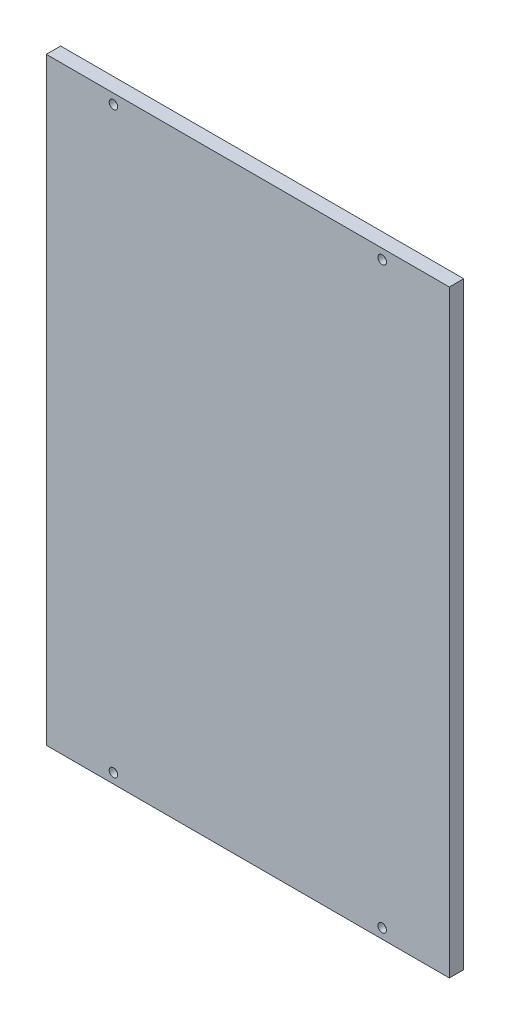
ISO-10303-21;
HEADER;
FILE_DESCRIPTION(('STEP AP214'),'2;1');
FILE_NAME('part.step','',(''),(''),'','','');
FILE_SCHEMA(('AUTOMOTIVE_DESIGN { 1 0 10303 214 1 1 1 1 }'));
ENDSEC;
DATA;
#1=APPLICATION_CONTEXT('core data for automotive mechanical design processes');
#2=APPLICATION_PROTOCOL_DEFINITION('international standard','automotive_design',2000,#1);
#3=PRODUCT_CONTEXT('',#1,'mechanical');
#4=PRODUCT('Part','Part','',(#3));
#5=PRODUCT_RELATED_PRODUCT_CATEGORY('part','',(#4));
#6=PRODUCT_DEFINITION_FORMATION('','',#4);
#7=PRODUCT_DEFINITION_CONTEXT('part definition',#1,'design');
#8=PRODUCT_DEFINITION('design','',#6,#7);
#9=PRODUCT_DEFINITION_SHAPE('','',#8);
#10=(LENGTH_UNIT() NAMED_UNIT(*) SI_UNIT(.MILLI.,.METRE.));
#11=(NAMED_UNIT(*) PLANE_ANGLE_UNIT() SI_UNIT($,.RADIAN.));
#12=(NAMED_UNIT(*) SI_UNIT($,.STERADIAN.) SOLID_ANGLE_UNIT());
#13=UNCERTAINTY_MEASURE_WITH_UNIT(LENGTH_MEASURE(1.E-05),#10,'distance_accuracy_value','');
#14=(GEOMETRIC_REPRESENTATION_CONTEXT(3) GLOBAL_UNCERTAINTY_ASSIGNED_CONTEXT((#13)) GLOBAL_UNIT_ASSIGNED_CONTEXT((#10,
#11,#12)) REPRESENTATION_CONTEXT('',''));
#15=CARTESIAN_POINT('',(0.,0.,0.));
#16=DIRECTION('',(0.,0.,1.));
#17=DIRECTION('',(1.,0.,0.));
#18=AXIS2_PLACEMENT_3D('',#15,#16,#17);
#19=CARTESIAN_POINT('',(-150.,-222.7,10.7));
#20=DIRECTION('',(1.,0.,0.));
#21=DIRECTION('',(0.,0.,-1.));
#22=AXIS2_PLACEMENT_3D('',#19,#20,#21);
#23=PLANE('',#22);
#24=DIRECTION('',(0.,-1.,0.));
#25=VECTOR('',#24,1.);
#26=CARTESIAN_POINT('',(-150.,-222.7,0.));
#27=LINE('',#26,#25);
#28=CARTESIAN_POINT('',(-150.,222.7,0.));
#29=VERTEX_POINT('',#28);
#30=CARTESIAN_POINT('',(-150.,-222.7,0.));
#31=VERTEX_POINT('',#30);
#32=EDGE_CURVE('E96',#29,#31,#27,.T.);
#33=ORIENTED_EDGE('',*,*,#32,.T.);
#34=DIRECTION('',(0.,0.,-1.));
#35=VECTOR('',#34,1.);
#36=CARTESIAN_POINT('',(-150.,-222.7,10.7));
#37=LINE('',#36,#35);
#38=CARTESIAN_POINT('',(-150.,-222.7,10.7));
#39=VERTEX_POINT('',#38);
#40=EDGE_CURVE('E11',#39,#31,#37,.T.);
#41=ORIENTED_EDGE('',*,*,#40,.F.);
#42=DIRECTION('',(0.,-1.,0.));
#43=VECTOR('',#42,1.);
#44=CARTESIAN_POINT('',(-150.,-222.7,10.7));
#45=LINE('',#44,#43);
#46=CARTESIAN_POINT('',(-150.,222.7,10.7));
#47=VERTEX_POINT('',#46);
#48=EDGE_CURVE('E84',#47,#39,#45,.T.);
#49=ORIENTED_EDGE('',*,*,#48,.F.);
#50=DIRECTION('',(0.,0.,-1.));
#51=VECTOR('',#50,1.);
#52=CARTESIAN_POINT('',(-150.,222.7,10.7));
#53=LINE('',#52,#51);
#54=EDGE_CURVE('E92',#47,#29,#53,.T.);
#55=ORIENTED_EDGE('',*,*,#54,.T.);
#56=EDGE_LOOP('',(#33,#41,#49,#55));
#57=FACE_BOUND('',#56,.T.);
#58=ADVANCED_FACE('F33',(#57),#23,.F.);
#59=CARTESIAN_POINT('',(150.,-222.7,10.7));
#60=DIRECTION('',(0.,1.,0.));
#61=DIRECTION('',(0.,0.,1.));
#62=AXIS2_PLACEMENT_3D('',#59,#60,#61);
#63=PLANE('',#62);
#64=DIRECTION('',(1.,0.,0.));
#65=VECTOR('',#64,1.);
#66=CARTESIAN_POINT('',(150.,-222.7,0.));
#67=LINE('',#66,#65);
#68=CARTESIAN_POINT('',(150.,-222.7,0.));
#69=VERTEX_POINT('',#68);
#70=EDGE_CURVE('E88',#31,#69,#67,.T.);
#71=ORIENTED_EDGE('',*,*,#70,.T.);
#72=DIRECTION('',(0.,0.,-1.));
#73=VECTOR('',#72,1.);
#74=CARTESIAN_POINT('',(150.,-222.7,10.7));
#75=LINE('',#74,#73);
#76=CARTESIAN_POINT('',(150.,-222.7,10.7));
#77=VERTEX_POINT('',#76);
#78=EDGE_CURVE('E41',#77,#69,#75,.T.);
#79=ORIENTED_EDGE('',*,*,#78,.F.);
#80=DIRECTION('',(1.,0.,0.));
#81=VECTOR('',#80,1.);
#82=CARTESIAN_POINT('',(150.,-222.7,10.7));
#83=LINE('',#82,#81);
#84=EDGE_CURVE('E79',#39,#77,#83,.T.);
#85=ORIENTED_EDGE('',*,*,#84,.F.);
#86=ORIENTED_EDGE('',*,*,#40,.T.);
#87=EDGE_LOOP('',(#71,#79,#85,#86));
#88=FACE_BOUND('',#87,.T.);
#89=ADVANCED_FACE('F87',(#88),#63,.F.);
#90=CARTESIAN_POINT('',(150.,-222.7,10.7));
#91=DIRECTION('',(-1.,0.,0.));
#92=DIRECTION('',(0.,0.,1.));
#93=AXIS2_PLACEMENT_3D('',#90,#91,#92);
#94=PLANE('',#93);
#95=DIRECTION('',(0.,1.,0.));
#96=VECTOR('',#95,1.);
#97=CARTESIAN_POINT('',(150.,-222.7,0.));
#98=LINE('',#97,#96);
#99=CARTESIAN_POINT('',(150.,222.7,0.));
#100=VERTEX_POINT('',#99);
#101=EDGE_CURVE('E66',#69,#100,#98,.T.);
#102=ORIENTED_EDGE('',*,*,#101,.T.);
#103=DIRECTION('',(0.,0.,-1.));
#104=VECTOR('',#103,1.);
#105=CARTESIAN_POINT('',(150.,222.7,10.7));
#106=LINE('',#105,#104);
#107=CARTESIAN_POINT('',(150.,222.7,10.7));
#108=VERTEX_POINT('',#107);
#109=EDGE_CURVE('E89',#108,#100,#106,.T.);
#110=ORIENTED_EDGE('',*,*,#109,.F.);
#111=DIRECTION('',(0.,1.,0.));
#112=VECTOR('',#111,1.);
#113=CARTESIAN_POINT('',(150.,-222.7,10.7));
#114=LINE('',#113,#112);
#115=EDGE_CURVE('E82',#77,#108,#114,.T.);
#116=ORIENTED_EDGE('',*,*,#115,.F.);
#117=ORIENTED_EDGE('',*,*,#78,.T.);
#118=EDGE_LOOP('',(#102,#110,#116,#117));
#119=FACE_BOUND('',#118,.T.);
#120=ADVANCED_FACE('F90',(#119),#94,.F.);
#121=CARTESIAN_POINT('',(150.,222.7,10.7));
#122=DIRECTION('',(0.,-1.,0.));
#123=DIRECTION('',(0.,0.,-1.));
#124=AXIS2_PLACEMENT_3D('',#121,#122,#123);
#125=PLANE('',#124);
#126=DIRECTION('',(-1.,0.,0.));
#127=VECTOR('',#126,1.);
#128=CARTESIAN_POINT('',(150.,222.7,0.));
#129=LINE('',#128,#127);
#130=EDGE_CURVE('E72',#100,#29,#129,.T.);
#131=ORIENTED_EDGE('',*,*,#130,.T.);
#132=ORIENTED_EDGE('',*,*,#54,.F.);
#133=DIRECTION('',(-1.,0.,0.));
#134=VECTOR('',#133,1.);
#135=CARTESIAN_POINT('',(150.,222.7,10.7));
#136=LINE('',#135,#134);
#137=EDGE_CURVE('E49',#108,#47,#136,.T.);
#138=ORIENTED_EDGE('',*,*,#137,.F.);
#139=ORIENTED_EDGE('',*,*,#109,.T.);
#140=EDGE_LOOP('',(#131,#132,#138,#139));
#141=FACE_BOUND('',#140,.T.);
#142=ADVANCED_FACE('F104',(#141),#125,.F.);
#143=CARTESIAN_POINT('',(0.,0.,10.7));
#144=DIRECTION('',(0.,0.,1.));
#145=DIRECTION('',(1.,0.,0.));
#146=AXIS2_PLACEMENT_3D('',#143,#144,#145);
#147=PLANE('',#146);
#148=CARTESIAN_POINT('',(100.,215.35,10.7));
#149=DIRECTION('',(0.,0.,-1.));
#150=DIRECTION('',(-1.,0.,0.));
#151=AXIS2_PLACEMENT_3D('',#148,#149,#150);
#152=CIRCLE('',#151,3.17500000000001);
#153=CARTESIAN_POINT('',(96.825,215.35,10.7));
#154=VERTEX_POINT('',#153);
#155=EDGE_CURVE('E145',#154,#154,#152,.T.);
#156=ORIENTED_EDGE('',*,*,#155,.T.);
#157=EDGE_LOOP('',(#156));
#158=FACE_BOUND('',#157,.T.);
#159=CARTESIAN_POINT('',(100.,-215.35,10.7));
#160=DIRECTION('',(0.,0.,-1.));
#161=DIRECTION('',(-1.,0.,0.));
#162=AXIS2_PLACEMENT_3D('',#159,#160,#161);
#163=CIRCLE('',#162,3.17500000000001);
#164=CARTESIAN_POINT('',(96.825,-215.35,10.7));
#165=VERTEX_POINT('',#164);
#166=EDGE_CURVE('E133',#165,#165,#163,.T.);
#167=ORIENTED_EDGE('',*,*,#166,.T.);
#168=EDGE_LOOP('',(#167));
#169=FACE_BOUND('',#168,.T.);
#170=CARTESIAN_POINT('',(-100.,-215.35,10.7));
#171=DIRECTION('',(0.,0.,-1.));
#172=DIRECTION('',(-1.,0.,0.));
#173=AXIS2_PLACEMENT_3D('',#170,#171,#172);
#174=CIRCLE('',#173,3.17500000000001);
#175=CARTESIAN_POINT('',(-103.175,-215.35,10.7));
#176=VERTEX_POINT('',#175);
#177=EDGE_CURVE('E121',#176,#176,#174,.T.);
#178=ORIENTED_EDGE('',*,*,#177,.T.);
#179=EDGE_LOOP('',(#178));
#180=FACE_BOUND('',#179,.T.);
#181=CARTESIAN_POINT('',(-100.,215.35,10.7));
#182=DIRECTION('',(0.,0.,-1.));
#183=DIRECTION('',(-1.,0.,0.));
#184=AXIS2_PLACEMENT_3D('',#181,#182,#183);
#185=CIRCLE('',#184,3.17500000000001);
#186=CARTESIAN_POINT('',(-103.175,215.35,10.7));
#187=VERTEX_POINT('',#186);
#188=EDGE_CURVE('E99',#187,#187,#185,.T.);
#189=ORIENTED_EDGE('',*,*,#188,.T.);
#190=EDGE_LOOP('',(#189));
#191=FACE_BOUND('',#190,.T.);
#192=ORIENTED_EDGE('',*,*,#48,.T.);
#193=ORIENTED_EDGE('',*,*,#84,.T.);
#194=ORIENTED_EDGE('',*,*,#115,.T.);
#195=ORIENTED_EDGE('',*,*,#137,.T.);
#196=EDGE_LOOP('',(#192,#193,#194,#195));
#197=FACE_BOUND('',#196,.T.);
#198=ADVANCED_FACE('F80',(#158,#169,#180,#191,#197),#147,.T.);
#199=CARTESIAN_POINT('',(0.,0.,0.));
#200=DIRECTION('',(0.,0.,1.));
#201=DIRECTION('',(1.,0.,0.));
#202=AXIS2_PLACEMENT_3D('',#199,#200,#201);
#203=PLANE('',#202);
#204=CARTESIAN_POINT('',(100.,215.35,0.));
#205=DIRECTION('',(0.,0.,-1.));
#206=DIRECTION('',(-1.,0.,0.));
#207=AXIS2_PLACEMENT_3D('',#204,#205,#206);
#208=CIRCLE('',#207,4.76000000000001);
#209=CARTESIAN_POINT('',(95.24,215.35,0.));
#210=VERTEX_POINT('',#209);
#211=EDGE_CURVE('E154',#210,#210,#208,.T.);
#212=ORIENTED_EDGE('',*,*,#211,.F.);
#213=EDGE_LOOP('',(#212));
#214=FACE_BOUND('',#213,.T.);
#215=CARTESIAN_POINT('',(100.,-215.35,0.));
#216=DIRECTION('',(0.,0.,-1.));
#217=DIRECTION('',(-1.,0.,0.));
#218=AXIS2_PLACEMENT_3D('',#215,#216,#217);
#219=CIRCLE('',#218,4.76000000000001);
#220=CARTESIAN_POINT('',(95.24,-215.35,0.));
#221=VERTEX_POINT('',#220);
#222=EDGE_CURVE('E142',#221,#221,#219,.T.);
#223=ORIENTED_EDGE('',*,*,#222,.F.);
#224=EDGE_LOOP('',(#223));
#225=FACE_BOUND('',#224,.T.);
#226=CARTESIAN_POINT('',(-100.,-215.35,0.));
#227=DIRECTION('',(0.,0.,-1.));
#228=DIRECTION('',(-1.,0.,0.));
#229=AXIS2_PLACEMENT_3D('',#226,#227,#228);
#230=CIRCLE('',#229,4.76000000000001);
#231=CARTESIAN_POINT('',(-104.76,-215.35,0.));
#232=VERTEX_POINT('',#231);
#233=EDGE_CURVE('E130',#232,#232,#230,.T.);
#234=ORIENTED_EDGE('',*,*,#233,.F.);
#235=EDGE_LOOP('',(#234));
#236=FACE_BOUND('',#235,.T.);
#237=CARTESIAN_POINT('',(-100.,215.35,0.));
#238=DIRECTION('',(0.,0.,-1.));
#239=DIRECTION('',(-1.,0.,0.));
#240=AXIS2_PLACEMENT_3D('',#237,#238,#239);
#241=CIRCLE('',#240,4.76000000000001);
#242=CARTESIAN_POINT('',(-104.76,215.35,0.));
#243=VERTEX_POINT('',#242);
#244=EDGE_CURVE('E118',#243,#243,#241,.T.);
#245=ORIENTED_EDGE('',*,*,#244,.F.);
#246=EDGE_LOOP('',(#245));
#247=FACE_BOUND('',#246,.T.);
#248=ORIENTED_EDGE('',*,*,#32,.F.);
#249=ORIENTED_EDGE('',*,*,#130,.F.);
#250=ORIENTED_EDGE('',*,*,#101,.F.);
#251=ORIENTED_EDGE('',*,*,#70,.F.);
#252=EDGE_LOOP('',(#248,#249,#250,#251));
#253=FACE_BOUND('',#252,.T.);
#254=ADVANCED_FACE('F107',(#214,#225,#236,#247,#253),#203,.F.);
#255=CARTESIAN_POINT('',(-100.,215.35,0.));
#256=DIRECTION('',(0.,0.,-1.));
#257=DIRECTION('',(-1.,0.,0.));
#258=AXIS2_PLACEMENT_3D('',#255,#256,#257);
#259=CYLINDRICAL_SURFACE('',#258,3.17500000000001);
#260=ORIENTED_EDGE('',*,*,#188,.F.);
#261=EDGE_LOOP('',(#260));
#262=FACE_BOUND('',#261,.T.);
#263=CARTESIAN_POINT('',(-100.,215.35,6.35));
#264=DIRECTION('',(0.,0.,-1.));
#265=DIRECTION('',(-1.,0.,0.));
#266=AXIS2_PLACEMENT_3D('',#263,#264,#265);
#267=CIRCLE('',#266,3.17500000000001);
#268=CARTESIAN_POINT('',(-103.175,215.35,6.35));
#269=VERTEX_POINT('',#268);
#270=EDGE_CURVE('E112',#269,#269,#267,.T.);
#271=ORIENTED_EDGE('',*,*,#270,.T.);
#272=EDGE_LOOP('',(#271));
#273=FACE_BOUND('',#272,.T.);
#274=ADVANCED_FACE('F162',(#262,#273),#259,.F.);
#275=CARTESIAN_POINT('',(-96.825,215.35,6.35));
#276=DIRECTION('',(0.,0.,1.));
#277=DIRECTION('',(1.,0.,0.));
#278=AXIS2_PLACEMENT_3D('',#275,#276,#277);
#279=PLANE('',#278);
#280=ORIENTED_EDGE('',*,*,#270,.F.);
#281=EDGE_LOOP('',(#280));
#282=FACE_BOUND('',#281,.T.);
#283=CARTESIAN_POINT('',(-100.,215.35,6.35));
#284=DIRECTION('',(0.,0.,-1.));
#285=DIRECTION('',(-1.,0.,0.));
#286=AXIS2_PLACEMENT_3D('',#283,#284,#285);
#287=CIRCLE('',#286,4.76000000000001);
#288=CARTESIAN_POINT('',(-104.76,215.35,6.35));
#289=VERTEX_POINT('',#288);
#290=EDGE_CURVE('E115',#289,#289,#287,.T.);
#291=ORIENTED_EDGE('',*,*,#290,.T.);
#292=EDGE_LOOP('',(#291));
#293=FACE_BOUND('',#292,.T.);
#294=ADVANCED_FACE('F173',(#282,#293),#279,.F.);
#295=CARTESIAN_POINT('',(-100.,215.35,0.));
#296=DIRECTION('',(0.,0.,-1.));
#297=DIRECTION('',(-1.,0.,0.));
#298=AXIS2_PLACEMENT_3D('',#295,#296,#297);
#299=CYLINDRICAL_SURFACE('',#298,4.76000000000001);
#300=ORIENTED_EDGE('',*,*,#290,.F.);
#301=EDGE_LOOP('',(#300));
#302=FACE_BOUND('',#301,.T.);
#303=ORIENTED_EDGE('',*,*,#244,.T.);
#304=EDGE_LOOP('',(#303));
#305=FACE_BOUND('',#304,.T.);
#306=ADVANCED_FACE('F170',(#302,#305),#299,.F.);
#307=CARTESIAN_POINT('',(-100.,-215.35,0.));
#308=DIRECTION('',(0.,0.,-1.));
#309=DIRECTION('',(-1.,0.,0.));
#310=AXIS2_PLACEMENT_3D('',#307,#308,#309);
#311=CYLINDRICAL_SURFACE('',#310,3.17500000000001);
#312=ORIENTED_EDGE('',*,*,#177,.F.);
#313=EDGE_LOOP('',(#312));
#314=FACE_BOUND('',#313,.T.);
#315=CARTESIAN_POINT('',(-100.,-215.35,6.35));
#316=DIRECTION('',(0.,0.,-1.));
#317=DIRECTION('',(-1.,0.,0.));
#318=AXIS2_PLACEMENT_3D('',#315,#316,#317);
#319=CIRCLE('',#318,3.17500000000001);
#320=CARTESIAN_POINT('',(-103.175,-215.35,6.35));
#321=VERTEX_POINT('',#320);
#322=EDGE_CURVE('E124',#321,#321,#319,.T.);
#323=ORIENTED_EDGE('',*,*,#322,.T.);
#324=EDGE_LOOP('',(#323));
#325=FACE_BOUND('',#324,.T.);
#326=ADVANCED_FACE('F172',(#314,#325),#311,.F.);
#327=CARTESIAN_POINT('',(-96.825,-215.35,6.35));
#328=DIRECTION('',(0.,0.,1.));
#329=DIRECTION('',(1.,0.,0.));
#330=AXIS2_PLACEMENT_3D('',#327,#328,#329);
#331=PLANE('',#330);
#332=ORIENTED_EDGE('',*,*,#322,.F.);
#333=EDGE_LOOP('',(#332));
#334=FACE_BOUND('',#333,.T.);
#335=CARTESIAN_POINT('',(-100.,-215.35,6.35));
#336=DIRECTION('',(0.,0.,-1.));
#337=DIRECTION('',(-1.,0.,0.));
#338=AXIS2_PLACEMENT_3D('',#335,#336,#337);
#339=CIRCLE('',#338,4.76000000000001);
#340=CARTESIAN_POINT('',(-104.76,-215.35,6.35));
#341=VERTEX_POINT('',#340);
#342=EDGE_CURVE('E127',#341,#341,#339,.T.);
#343=ORIENTED_EDGE('',*,*,#342,.T.);
#344=EDGE_LOOP('',(#343));
#345=FACE_BOUND('',#344,.T.);
#346=ADVANCED_FACE('F180',(#334,#345),#331,.F.);
#347=CARTESIAN_POINT('',(-100.,-215.35,0.));
#348=DIRECTION('',(0.,0.,-1.));
#349=DIRECTION('',(-1.,0.,0.));
#350=AXIS2_PLACEMENT_3D('',#347,#348,#349);
#351=CYLINDRICAL_SURFACE('',#350,4.76000000000001);
#352=ORIENTED_EDGE('',*,*,#342,.F.);
#353=EDGE_LOOP('',(#352));
#354=FACE_BOUND('',#353,.T.);
#355=ORIENTED_EDGE('',*,*,#233,.T.);
#356=EDGE_LOOP('',(#355));
#357=FACE_BOUND('',#356,.T.);
#358=ADVANCED_FACE('F234',(#354,#357),#351,.F.);
#359=CARTESIAN_POINT('',(100.,-215.35,0.));
#360=DIRECTION('',(0.,0.,-1.));
#361=DIRECTION('',(-1.,0.,0.));
#362=AXIS2_PLACEMENT_3D('',#359,#360,#361);
#363=CYLINDRICAL_SURFACE('',#362,3.17500000000001);
#364=ORIENTED_EDGE('',*,*,#166,.F.);
#365=EDGE_LOOP('',(#364));
#366=FACE_BOUND('',#365,.T.);
#367=CARTESIAN_POINT('',(100.,-215.35,6.35));
#368=DIRECTION('',(0.,0.,-1.));
#369=DIRECTION('',(-1.,0.,0.));
#370=AXIS2_PLACEMENT_3D('',#367,#368,#369);
#371=CIRCLE('',#370,3.17500000000001);
#372=CARTESIAN_POINT('',(96.825,-215.35,6.35));
#373=VERTEX_POINT('',#372);
#374=EDGE_CURVE('E136',#373,#373,#371,.T.);
#375=ORIENTED_EDGE('',*,*,#374,.T.);
#376=EDGE_LOOP('',(#375));
#377=FACE_BOUND('',#376,.T.);
#378=ADVANCED_FACE('F244',(#366,#377),#363,.F.);
#379=CARTESIAN_POINT('',(103.175,-215.35,6.35));
#380=DIRECTION('',(0.,0.,1.));
#381=DIRECTION('',(1.,0.,0.));
#382=AXIS2_PLACEMENT_3D('',#379,#380,#381);
#383=PLANE('',#382);
#384=ORIENTED_EDGE('',*,*,#374,.F.);
#385=EDGE_LOOP('',(#384));
#386=FACE_BOUND('',#385,.T.);
#387=CARTESIAN_POINT('',(100.,-215.35,6.35));
#388=DIRECTION('',(0.,0.,-1.));
#389=DIRECTION('',(-1.,0.,0.));
#390=AXIS2_PLACEMENT_3D('',#387,#388,#389);
#391=CIRCLE('',#390,4.76000000000001);
#392=CARTESIAN_POINT('',(95.24,-215.35,6.35));
#393=VERTEX_POINT('',#392);
#394=EDGE_CURVE('E139',#393,#393,#391,.T.);
#395=ORIENTED_EDGE('',*,*,#394,.T.);
#396=EDGE_LOOP('',(#395));
#397=FACE_BOUND('',#396,.T.);
#398=ADVANCED_FACE('F254',(#386,#397),#383,.F.);
#399=CARTESIAN_POINT('',(100.,-215.35,0.));
#400=DIRECTION('',(0.,0.,-1.));
#401=DIRECTION('',(-1.,0.,0.));
#402=AXIS2_PLACEMENT_3D('',#399,#400,#401);
#403=CYLINDRICAL_SURFACE('',#402,4.76000000000001);
#404=ORIENTED_EDGE('',*,*,#394,.F.);
#405=EDGE_LOOP('',(#404));
#406=FACE_BOUND('',#405,.T.);
#407=ORIENTED_EDGE('',*,*,#222,.T.);
#408=EDGE_LOOP('',(#407));
#409=FACE_BOUND('',#408,.T.);
#410=ADVANCED_FACE('F264',(#406,#409),#403,.F.);
#411=CARTESIAN_POINT('',(100.,215.35,0.));
#412=DIRECTION('',(0.,0.,-1.));
#413=DIRECTION('',(-1.,0.,0.));
#414=AXIS2_PLACEMENT_3D('',#411,#412,#413);
#415=CYLINDRICAL_SURFACE('',#414,3.17500000000001);
#416=ORIENTED_EDGE('',*,*,#155,.F.);
#417=EDGE_LOOP('',(#416));
#418=FACE_BOUND('',#417,.T.);
#419=CARTESIAN_POINT('',(100.,215.35,6.35));
#420=DIRECTION('',(0.,0.,-1.));
#421=DIRECTION('',(-1.,0.,0.));
#422=AXIS2_PLACEMENT_3D('',#419,#420,#421);
#423=CIRCLE('',#422,3.17500000000001);
#424=CARTESIAN_POINT('',(96.825,215.35,6.35));
#425=VERTEX_POINT('',#424);
#426=EDGE_CURVE('E148',#425,#425,#423,.T.);
#427=ORIENTED_EDGE('',*,*,#426,.T.);
#428=EDGE_LOOP('',(#427));
#429=FACE_BOUND('',#428,.T.);
#430=ADVANCED_FACE('F274',(#418,#429),#415,.F.);
#431=CARTESIAN_POINT('',(103.175,215.35,6.35));
#432=DIRECTION('',(0.,0.,1.));
#433=DIRECTION('',(1.,0.,0.));
#434=AXIS2_PLACEMENT_3D('',#431,#432,#433);
#435=PLANE('',#434);
#436=ORIENTED_EDGE('',*,*,#426,.F.);
#437=EDGE_LOOP('',(#436));
#438=FACE_BOUND('',#437,.T.);
#439=CARTESIAN_POINT('',(100.,215.35,6.35));
#440=DIRECTION('',(0.,0.,-1.));
#441=DIRECTION('',(-1.,0.,0.));
#442=AXIS2_PLACEMENT_3D('',#439,#440,#441);
#443=CIRCLE('',#442,4.76000000000001);
#444=CARTESIAN_POINT('',(95.24,215.35,6.35));
#445=VERTEX_POINT('',#444);
#446=EDGE_CURVE('E151',#445,#445,#443,.T.);
#447=ORIENTED_EDGE('',*,*,#446,.T.);
#448=EDGE_LOOP('',(#447));
#449=FACE_BOUND('',#448,.T.);
#450=ADVANCED_FACE('F284',(#438,#449),#435,.F.);
#451=CARTESIAN_POINT('',(100.,215.35,0.));
#452=DIRECTION('',(0.,0.,-1.));
#453=DIRECTION('',(-1.,0.,0.));
#454=AXIS2_PLACEMENT_3D('',#451,#452,#453);
#455=CYLINDRICAL_SURFACE('',#454,4.76000000000001);
#456=ORIENTED_EDGE('',*,*,#446,.F.);
#457=EDGE_LOOP('',(#456));
#458=FACE_BOUND('',#457,.T.);
#459=ORIENTED_EDGE('',*,*,#211,.T.);
#460=EDGE_LOOP('',(#459));
#461=FACE_BOUND('',#460,.T.);
#462=ADVANCED_FACE('F158',(#458,#461),#455,.F.);
#463=CLOSED_SHELL('',(#58,#89,#120,#142,#198,#254,#274,#294,#306,#326,#346,#358,#378,#398,#410,
#430,#450,#462));
#464=MANIFOLD_SOLID_BREP('B2',#463);
#465=ADVANCED_BREP_SHAPE_REPRESENTATION('',(#18,#464),#14);
#466=SHAPE_DEFINITION_REPRESENTATION(#9,#465);
ENDSEC;
END-ISO-10303-21;
